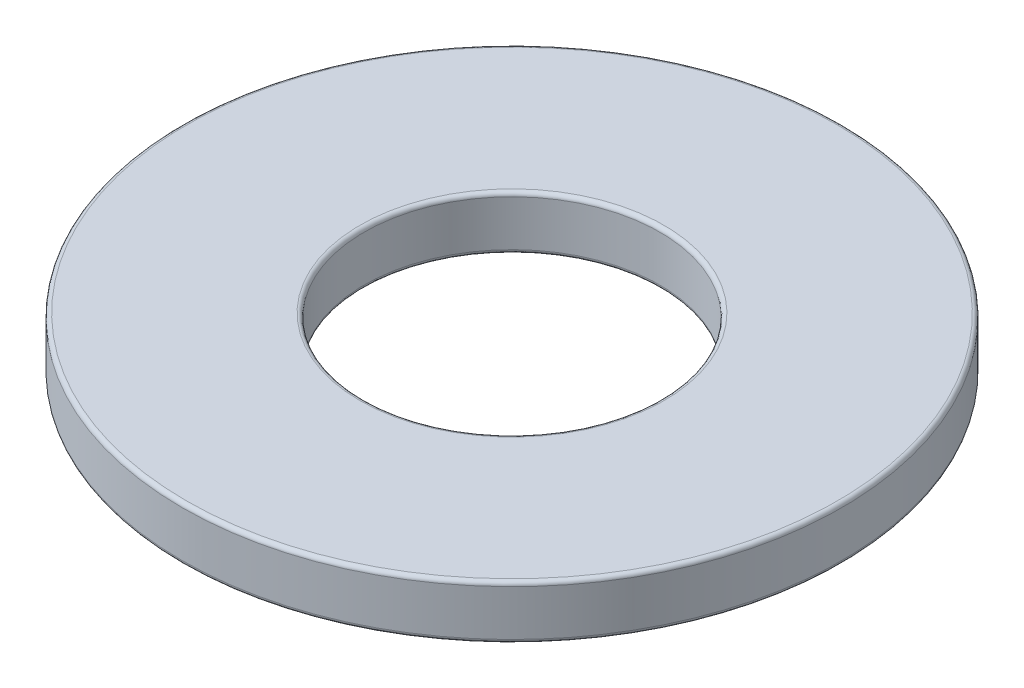
ISO-10303-21;
HEADER;
FILE_DESCRIPTION(('STEP AP214'),'2;1');
FILE_NAME('part.step','',(''),(''),'','','');
FILE_SCHEMA(('AUTOMOTIVE_DESIGN { 1 0 10303 214 1 1 1 1 }'));
ENDSEC;
DATA;
#1=APPLICATION_CONTEXT('core data for automotive mechanical design processes');
#2=APPLICATION_PROTOCOL_DEFINITION('international standard','automotive_design',2000,#1);
#3=PRODUCT_CONTEXT('',#1,'mechanical');
#4=PRODUCT('Part','Part','',(#3));
#5=PRODUCT_RELATED_PRODUCT_CATEGORY('part','',(#4));
#6=PRODUCT_DEFINITION_FORMATION('','',#4);
#7=PRODUCT_DEFINITION_CONTEXT('part definition',#1,'design');
#8=PRODUCT_DEFINITION('design','',#6,#7);
#9=PRODUCT_DEFINITION_SHAPE('','',#8);
#10=(LENGTH_UNIT() NAMED_UNIT(*) SI_UNIT(.MILLI.,.METRE.));
#11=(NAMED_UNIT(*) PLANE_ANGLE_UNIT() SI_UNIT($,.RADIAN.));
#12=(NAMED_UNIT(*) SI_UNIT($,.STERADIAN.) SOLID_ANGLE_UNIT());
#13=UNCERTAINTY_MEASURE_WITH_UNIT(LENGTH_MEASURE(1.E-05),#10,'distance_accuracy_value','');
#14=(GEOMETRIC_REPRESENTATION_CONTEXT(3) GLOBAL_UNCERTAINTY_ASSIGNED_CONTEXT((#13)) GLOBAL_UNIT_ASSIGNED_CONTEXT((#10,
#11,#12)) REPRESENTATION_CONTEXT('',''));
#15=CARTESIAN_POINT('',(0.,0.,0.));
#16=DIRECTION('',(0.,0.,1.));
#17=DIRECTION('',(1.,0.,0.));
#18=AXIS2_PLACEMENT_3D('',#15,#16,#17);
#19=CARTESIAN_POINT('',(0.,0.8,0.));
#20=DIRECTION('',(0.,1.,0.));
#21=DIRECTION('',(0.,0.,1.));
#22=AXIS2_PLACEMENT_3D('',#19,#20,#21);
#23=PLANE('',#22);
#24=CARTESIAN_POINT('',(0.,0.8,0.));
#25=DIRECTION('',(0.,1.,0.));
#26=DIRECTION('',(0.,0.,1.));
#27=AXIS2_PLACEMENT_3D('',#24,#25,#26);
#28=CIRCLE('',#27,2.26);
#29=CARTESIAN_POINT('',(0.,0.8,2.26));
#30=VERTEX_POINT('',#29);
#31=EDGE_CURVE('E51',#30,#30,#28,.F.);
#32=ORIENTED_EDGE('',*,*,#31,.T.);
#33=EDGE_LOOP('',(#32));
#34=FACE_BOUND('',#33,.T.);
#35=CARTESIAN_POINT('',(0.,0.8,0.));
#36=DIRECTION('',(0.,1.,0.));
#37=DIRECTION('',(0.,0.,1.));
#38=AXIS2_PLACEMENT_3D('',#35,#36,#37);
#39=CIRCLE('',#38,4.84);
#40=CARTESIAN_POINT('',(0.,0.8,4.84));
#41=VERTEX_POINT('',#40);
#42=EDGE_CURVE('E54',#41,#41,#39,.T.);
#43=ORIENTED_EDGE('',*,*,#42,.T.);
#44=EDGE_LOOP('',(#43));
#45=FACE_BOUND('',#44,.T.);
#46=ADVANCED_FACE('F31',(#34,#45),#23,.T.);
#47=CARTESIAN_POINT('',(0.,0.,0.));
#48=DIRECTION('',(0.,1.,0.));
#49=DIRECTION('',(0.,0.,1.));
#50=AXIS2_PLACEMENT_3D('',#47,#48,#49);
#51=PLANE('',#50);
#52=CARTESIAN_POINT('',(0.,0.,0.));
#53=DIRECTION('',(0.,1.,0.));
#54=DIRECTION('',(0.,0.,1.));
#55=AXIS2_PLACEMENT_3D('',#52,#53,#54);
#56=CIRCLE('',#55,4.84);
#57=CARTESIAN_POINT('',(0.,0.,4.84));
#58=VERTEX_POINT('',#57);
#59=EDGE_CURVE('E10',#58,#58,#56,.F.);
#60=ORIENTED_EDGE('',*,*,#59,.T.);
#61=EDGE_LOOP('',(#60));
#62=FACE_BOUND('',#61,.T.);
#63=CARTESIAN_POINT('',(0.,0.,0.));
#64=DIRECTION('',(0.,1.,0.));
#65=DIRECTION('',(0.,0.,1.));
#66=AXIS2_PLACEMENT_3D('',#63,#64,#65);
#67=CIRCLE('',#66,2.26);
#68=CARTESIAN_POINT('',(0.,0.,2.26));
#69=VERTEX_POINT('',#68);
#70=EDGE_CURVE('E38',#69,#69,#67,.T.);
#71=ORIENTED_EDGE('',*,*,#70,.T.);
#72=EDGE_LOOP('',(#71));
#73=FACE_BOUND('',#72,.T.);
#74=ADVANCED_FACE('F75',(#62,#73),#51,.F.);
#75=CARTESIAN_POINT('',(0.,0.8,0.));
#76=DIRECTION('',(0.,-1.,0.));
#77=DIRECTION('',(0.,0.,-1.));
#78=AXIS2_PLACEMENT_3D('',#75,#76,#77);
#79=CYLINDRICAL_SURFACE('',#78,4.9);
#80=CARTESIAN_POINT('',(0.,0.74,0.));
#81=DIRECTION('',(0.,1.,0.));
#82=DIRECTION('',(0.,0.,1.));
#83=AXIS2_PLACEMENT_3D('',#80,#81,#82);
#84=CIRCLE('',#83,4.9);
#85=CARTESIAN_POINT('',(0.,0.74,4.9));
#86=VERTEX_POINT('',#85);
#87=EDGE_CURVE('E42',#86,#86,#84,.F.);
#88=ORIENTED_EDGE('',*,*,#87,.T.);
#89=EDGE_LOOP('',(#88));
#90=FACE_BOUND('',#89,.T.);
#91=CARTESIAN_POINT('',(0.,0.06,0.));
#92=DIRECTION('',(0.,1.,0.));
#93=DIRECTION('',(0.,0.,1.));
#94=AXIS2_PLACEMENT_3D('',#91,#92,#93);
#95=CIRCLE('',#94,4.9);
#96=CARTESIAN_POINT('',(0.,0.06,4.9));
#97=VERTEX_POINT('',#96);
#98=EDGE_CURVE('E46',#97,#97,#95,.T.);
#99=ORIENTED_EDGE('',*,*,#98,.T.);
#100=EDGE_LOOP('',(#99));
#101=FACE_BOUND('',#100,.T.);
#102=ADVANCED_FACE('F81',(#90,#101),#79,.T.);
#103=CARTESIAN_POINT('',(0.,0.8,0.));
#104=DIRECTION('',(0.,-1.,0.));
#105=DIRECTION('',(0.,0.,-1.));
#106=AXIS2_PLACEMENT_3D('',#103,#104,#105);
#107=CYLINDRICAL_SURFACE('',#106,2.2);
#108=CARTESIAN_POINT('',(0.,0.74,0.));
#109=DIRECTION('',(0.,1.,0.));
#110=DIRECTION('',(0.,0.,1.));
#111=AXIS2_PLACEMENT_3D('',#108,#109,#110);
#112=CIRCLE('',#111,2.2);
#113=CARTESIAN_POINT('',(0.,0.74,2.2));
#114=VERTEX_POINT('',#113);
#115=EDGE_CURVE('E57',#114,#114,#112,.T.);
#116=ORIENTED_EDGE('',*,*,#115,.T.);
#117=EDGE_LOOP('',(#116));
#118=FACE_BOUND('',#117,.T.);
#119=CARTESIAN_POINT('',(0.,0.06,0.));
#120=DIRECTION('',(0.,1.,0.));
#121=DIRECTION('',(0.,0.,1.));
#122=AXIS2_PLACEMENT_3D('',#119,#120,#121);
#123=CIRCLE('',#122,2.2);
#124=CARTESIAN_POINT('',(0.,0.06,2.2));
#125=VERTEX_POINT('',#124);
#126=EDGE_CURVE('E60',#125,#125,#123,.F.);
#127=ORIENTED_EDGE('',*,*,#126,.T.);
#128=EDGE_LOOP('',(#127));
#129=FACE_BOUND('',#128,.T.);
#130=ADVANCED_FACE('F64',(#118,#129),#107,.F.);
#131=CARTESIAN_POINT('',(0.,0.74,0.));
#132=DIRECTION('',(0.,1.,0.));
#133=DIRECTION('',(0.,0.,1.));
#134=AXIS2_PLACEMENT_3D('',#131,#132,#133);
#135=TOROIDAL_SURFACE('',#134,2.26,0.06);
#136=ORIENTED_EDGE('',*,*,#31,.F.);
#137=EDGE_LOOP('',(#136));
#138=FACE_BOUND('',#137,.T.);
#139=ORIENTED_EDGE('',*,*,#115,.F.);
#140=EDGE_LOOP('',(#139));
#141=FACE_BOUND('',#140,.T.);
#142=ADVANCED_FACE('F89',(#138,#141),#135,.T.);
#143=CARTESIAN_POINT('',(0.,0.74,0.));
#144=DIRECTION('',(0.,1.,0.));
#145=DIRECTION('',(0.,0.,1.));
#146=AXIS2_PLACEMENT_3D('',#143,#144,#145);
#147=TOROIDAL_SURFACE('',#146,4.84,0.06);
#148=ORIENTED_EDGE('',*,*,#87,.F.);
#149=EDGE_LOOP('',(#148));
#150=FACE_BOUND('',#149,.T.);
#151=ORIENTED_EDGE('',*,*,#42,.F.);
#152=EDGE_LOOP('',(#151));
#153=FACE_BOUND('',#152,.T.);
#154=ADVANCED_FACE('F72',(#150,#153),#147,.T.);
#155=CARTESIAN_POINT('',(0.,0.06,0.));
#156=DIRECTION('',(0.,1.,0.));
#157=DIRECTION('',(0.,0.,1.));
#158=AXIS2_PLACEMENT_3D('',#155,#156,#157);
#159=TOROIDAL_SURFACE('',#158,4.84,0.06);
#160=ORIENTED_EDGE('',*,*,#59,.F.);
#161=EDGE_LOOP('',(#160));
#162=FACE_BOUND('',#161,.T.);
#163=ORIENTED_EDGE('',*,*,#98,.F.);
#164=EDGE_LOOP('',(#163));
#165=FACE_BOUND('',#164,.T.);
#166=ADVANCED_FACE('F68',(#162,#165),#159,.T.);
#167=CARTESIAN_POINT('',(0.,0.06,0.));
#168=DIRECTION('',(0.,1.,0.));
#169=DIRECTION('',(0.,0.,1.));
#170=AXIS2_PLACEMENT_3D('',#167,#168,#169);
#171=TOROIDAL_SURFACE('',#170,2.26,0.06);
#172=ORIENTED_EDGE('',*,*,#126,.F.);
#173=EDGE_LOOP('',(#172));
#174=FACE_BOUND('',#173,.T.);
#175=ORIENTED_EDGE('',*,*,#70,.F.);
#176=EDGE_LOOP('',(#175));
#177=FACE_BOUND('',#176,.T.);
#178=ADVANCED_FACE('F33',(#174,#177),#171,.T.);
#179=CLOSED_SHELL('',(#46,#74,#102,#130,#142,#154,#166,#178));
#180=MANIFOLD_SOLID_BREP('B2',#179);
#181=ADVANCED_BREP_SHAPE_REPRESENTATION('',(#18,#180),#14);
#182=SHAPE_DEFINITION_REPRESENTATION(#9,#181);
ENDSEC;
END-ISO-10303-21;
